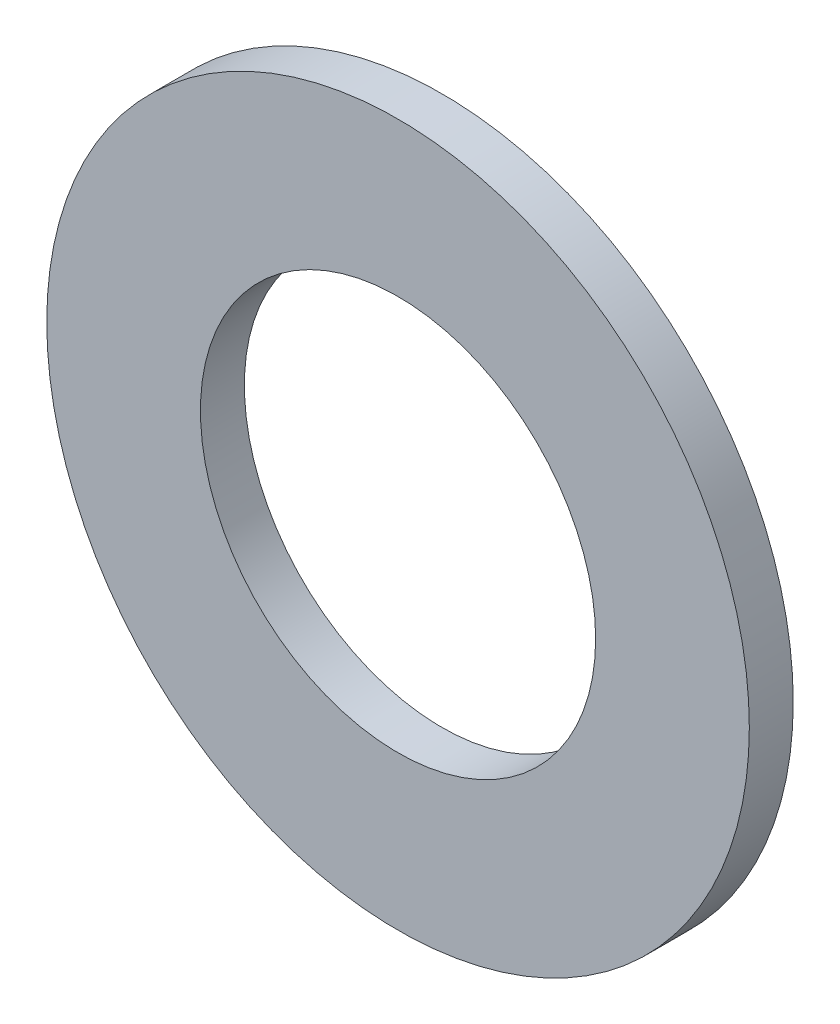
ISO-10303-21;
HEADER;
FILE_DESCRIPTION(('STEP AP214'),'2;1');
FILE_NAME('part.step','',(''),(''),'','','');
FILE_SCHEMA(('AUTOMOTIVE_DESIGN { 1 0 10303 214 1 1 1 1 }'));
ENDSEC;
DATA;
#1=APPLICATION_CONTEXT('core data for automotive mechanical design processes');
#2=APPLICATION_PROTOCOL_DEFINITION('international standard','automotive_design',2000,#1);
#3=PRODUCT_CONTEXT('',#1,'mechanical');
#4=PRODUCT('Part','Part','',(#3));
#5=PRODUCT_RELATED_PRODUCT_CATEGORY('part','',(#4));
#6=PRODUCT_DEFINITION_FORMATION('','',#4);
#7=PRODUCT_DEFINITION_CONTEXT('part definition',#1,'design');
#8=PRODUCT_DEFINITION('design','',#6,#7);
#9=PRODUCT_DEFINITION_SHAPE('','',#8);
#10=(LENGTH_UNIT() NAMED_UNIT(*) SI_UNIT(.MILLI.,.METRE.));
#11=(NAMED_UNIT(*) PLANE_ANGLE_UNIT() SI_UNIT($,.RADIAN.));
#12=(NAMED_UNIT(*) SI_UNIT($,.STERADIAN.) SOLID_ANGLE_UNIT());
#13=UNCERTAINTY_MEASURE_WITH_UNIT(LENGTH_MEASURE(1.E-05),#10,'distance_accuracy_value','');
#14=(GEOMETRIC_REPRESENTATION_CONTEXT(3) GLOBAL_UNCERTAINTY_ASSIGNED_CONTEXT((#13)) GLOBAL_UNIT_ASSIGNED_CONTEXT((#10,
#11,#12)) REPRESENTATION_CONTEXT('',''));
#15=CARTESIAN_POINT('',(0.,0.,0.));
#16=DIRECTION('',(0.,0.,1.));
#17=DIRECTION('',(1.,0.,0.));
#18=AXIS2_PLACEMENT_3D('',#15,#16,#17);
#19=CARTESIAN_POINT('',(0.,0.,1.));
#20=DIRECTION('',(0.,0.,-1.));
#21=DIRECTION('',(-1.,0.,0.));
#22=AXIS2_PLACEMENT_3D('',#19,#20,#21);
#23=CYLINDRICAL_SURFACE('',#22,8.);
#24=CARTESIAN_POINT('',(0.,0.,1.));
#25=DIRECTION('',(0.,0.,1.));
#26=DIRECTION('',(1.,0.,0.));
#27=AXIS2_PLACEMENT_3D('',#24,#25,#26);
#28=CIRCLE('',#27,8.);
#29=CARTESIAN_POINT('',(8.,0.,1.));
#30=VERTEX_POINT('',#29);
#31=EDGE_CURVE('E10',#30,#30,#28,.T.);
#32=ORIENTED_EDGE('',*,*,#31,.F.);
#33=EDGE_LOOP('',(#32));
#34=FACE_BOUND('',#33,.T.);
#35=CARTESIAN_POINT('',(0.,0.,0.));
#36=DIRECTION('',(0.,0.,1.));
#37=DIRECTION('',(1.,0.,0.));
#38=AXIS2_PLACEMENT_3D('',#35,#36,#37);
#39=CIRCLE('',#38,8.);
#40=CARTESIAN_POINT('',(8.,0.,0.));
#41=VERTEX_POINT('',#40);
#42=EDGE_CURVE('E40',#41,#41,#39,.T.);
#43=ORIENTED_EDGE('',*,*,#42,.T.);
#44=EDGE_LOOP('',(#43));
#45=FACE_BOUND('',#44,.T.);
#46=ADVANCED_FACE('F37',(#34,#45),#23,.T.);
#47=CARTESIAN_POINT('',(0.,0.,1.));
#48=DIRECTION('',(0.,0.,1.));
#49=DIRECTION('',(1.,0.,0.));
#50=AXIS2_PLACEMENT_3D('',#47,#48,#49);
#51=PLANE('',#50);
#52=CARTESIAN_POINT('',(0.,0.,1.));
#53=DIRECTION('',(0.,0.,1.));
#54=DIRECTION('',(1.,0.,0.));
#55=AXIS2_PLACEMENT_3D('',#52,#53,#54);
#56=CIRCLE('',#55,4.5);
#57=CARTESIAN_POINT('',(4.5,0.,1.));
#58=VERTEX_POINT('',#57);
#59=EDGE_CURVE('E51',#58,#58,#56,.T.);
#60=ORIENTED_EDGE('',*,*,#59,.F.);
#61=EDGE_LOOP('',(#60));
#62=FACE_BOUND('',#61,.T.);
#63=ORIENTED_EDGE('',*,*,#31,.T.);
#64=EDGE_LOOP('',(#63));
#65=FACE_BOUND('',#64,.T.);
#66=ADVANCED_FACE('F68',(#62,#65),#51,.T.);
#67=CARTESIAN_POINT('',(0.,0.,0.));
#68=DIRECTION('',(0.,0.,1.));
#69=DIRECTION('',(1.,0.,0.));
#70=AXIS2_PLACEMENT_3D('',#67,#68,#69);
#71=PLANE('',#70);
#72=CARTESIAN_POINT('',(0.,0.,0.));
#73=DIRECTION('',(0.,0.,1.));
#74=DIRECTION('',(1.,0.,0.));
#75=AXIS2_PLACEMENT_3D('',#72,#73,#74);
#76=CIRCLE('',#75,4.5);
#77=CARTESIAN_POINT('',(4.5,0.,0.));
#78=VERTEX_POINT('',#77);
#79=EDGE_CURVE('E49',#78,#78,#76,.T.);
#80=ORIENTED_EDGE('',*,*,#79,.T.);
#81=EDGE_LOOP('',(#80));
#82=FACE_BOUND('',#81,.T.);
#83=ORIENTED_EDGE('',*,*,#42,.F.);
#84=EDGE_LOOP('',(#83));
#85=FACE_BOUND('',#84,.T.);
#86=ADVANCED_FACE('F59',(#82,#85),#71,.F.);
#87=CARTESIAN_POINT('',(0.,0.,0.));
#88=DIRECTION('',(0.,0.,1.));
#89=DIRECTION('',(1.,0.,0.));
#90=AXIS2_PLACEMENT_3D('',#87,#88,#89);
#91=CYLINDRICAL_SURFACE('',#90,4.5);
#92=ORIENTED_EDGE('',*,*,#79,.F.);
#93=EDGE_LOOP('',(#92));
#94=FACE_BOUND('',#93,.T.);
#95=ORIENTED_EDGE('',*,*,#59,.T.);
#96=EDGE_LOOP('',(#95));
#97=FACE_BOUND('',#96,.T.);
#98=ADVANCED_FACE('F62',(#94,#97),#91,.F.);
#99=CLOSED_SHELL('',(#46,#66,#86,#98));
#100=MANIFOLD_SOLID_BREP('B2',#99);
#101=ADVANCED_BREP_SHAPE_REPRESENTATION('',(#18,#100),#14);
#102=SHAPE_DEFINITION_REPRESENTATION(#9,#101);
ENDSEC;
END-ISO-10303-21;
